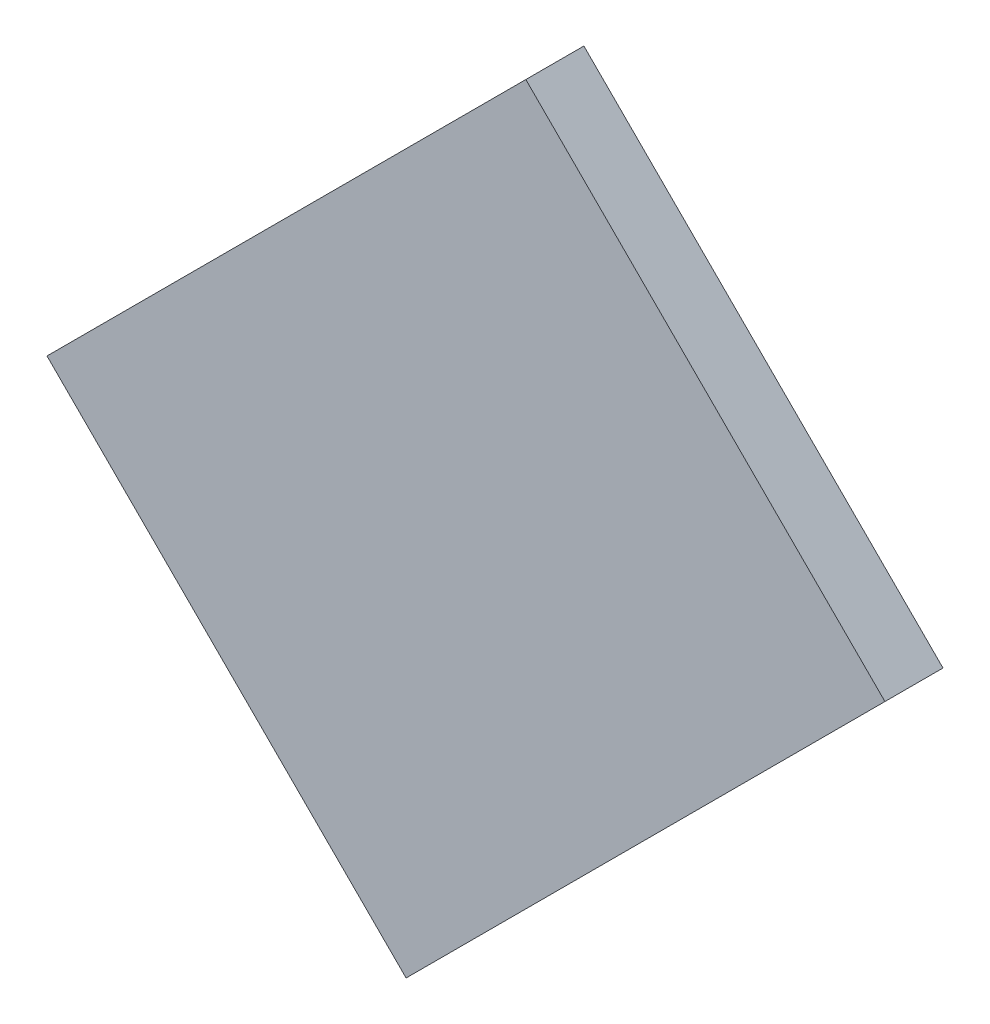
ISO-10303-21;
HEADER;
FILE_DESCRIPTION(('STEP AP214'),'2;1');
FILE_NAME('part.step','',(''),(''),'','','');
FILE_SCHEMA(('AUTOMOTIVE_DESIGN { 1 0 10303 214 1 1 1 1 }'));
ENDSEC;
DATA;
#1=APPLICATION_CONTEXT('core data for automotive mechanical design processes');
#2=APPLICATION_PROTOCOL_DEFINITION('international standard','automotive_design',2000,#1);
#3=PRODUCT_CONTEXT('',#1,'mechanical');
#4=PRODUCT('Part','Part','',(#3));
#5=PRODUCT_RELATED_PRODUCT_CATEGORY('part','',(#4));
#6=PRODUCT_DEFINITION_FORMATION('','',#4);
#7=PRODUCT_DEFINITION_CONTEXT('part definition',#1,'design');
#8=PRODUCT_DEFINITION('design','',#6,#7);
#9=PRODUCT_DEFINITION_SHAPE('','',#8);
#10=(LENGTH_UNIT() NAMED_UNIT(*) SI_UNIT(.MILLI.,.METRE.));
#11=(NAMED_UNIT(*) PLANE_ANGLE_UNIT() SI_UNIT($,.RADIAN.));
#12=(NAMED_UNIT(*) SI_UNIT($,.STERADIAN.) SOLID_ANGLE_UNIT());
#13=UNCERTAINTY_MEASURE_WITH_UNIT(LENGTH_MEASURE(1.E-05),#10,'distance_accuracy_value','');
#14=(GEOMETRIC_REPRESENTATION_CONTEXT(3) GLOBAL_UNCERTAINTY_ASSIGNED_CONTEXT((#13)) GLOBAL_UNIT_ASSIGNED_CONTEXT((#10,
#11,#12)) REPRESENTATION_CONTEXT('',''));
#15=CARTESIAN_POINT('',(0.,0.,0.));
#16=DIRECTION('',(0.,0.,1.));
#17=DIRECTION('',(1.,0.,0.));
#18=AXIS2_PLACEMENT_3D('',#15,#16,#17);
#19=CARTESIAN_POINT('',(7.2985453335,7.7864546665,0.76487));
#20=DIRECTION('',(0.,0.,-1.));
#21=DIRECTION('',(-1.,0.,0.));
#22=AXIS2_PLACEMENT_3D('',#19,#20,#21);
#23=PLANE('',#22);
#24=DIRECTION('',(0.707106781186548,0.707106781186548,0.));
#25=VECTOR('',#24,1.);
#26=CARTESIAN_POINT('',(7.051058,7.751099333,0.76487));
#27=LINE('',#26,#25);
#28=CARTESIAN_POINT('',(7.051058,7.751099333,0.76487));
#29=VERTEX_POINT('',#28);
#30=CARTESIAN_POINT('',(7.333900667,8.033942,0.76487));
#31=VERTEX_POINT('',#30);
#32=EDGE_CURVE('E55',#29,#31,#27,.T.);
#33=ORIENTED_EDGE('',*,*,#32,.T.);
#34=DIRECTION('',(0.707106781186548,-0.707106781186548,0.));
#35=VECTOR('',#34,1.);
#36=CARTESIAN_POINT('',(7.333900667,8.033942,0.76487));
#37=LINE('',#36,#35);
#38=CARTESIAN_POINT('',(7.546032667,7.82181,0.76487));
#39=VERTEX_POINT('',#38);
#40=EDGE_CURVE('E57',#31,#39,#37,.T.);
#41=ORIENTED_EDGE('',*,*,#40,.T.);
#42=DIRECTION('',(-0.707106781186548,-0.707106781186548,0.));
#43=VECTOR('',#42,1.);
#44=CARTESIAN_POINT('',(7.546032667,7.82181,0.76487));
#45=LINE('',#44,#43);
#46=CARTESIAN_POINT('',(7.26319,7.538967333,0.76487));
#47=VERTEX_POINT('',#46);
#48=EDGE_CURVE('E20',#39,#47,#45,.T.);
#49=ORIENTED_EDGE('',*,*,#48,.T.);
#50=DIRECTION('',(-0.707106781186548,0.707106781186548,0.));
#51=VECTOR('',#50,1.);
#52=CARTESIAN_POINT('',(7.26319,7.538967333,0.76487));
#53=LINE('',#52,#51);
#54=EDGE_CURVE('E80',#47,#29,#53,.T.);
#55=ORIENTED_EDGE('',*,*,#54,.T.);
#56=EDGE_LOOP('',(#33,#41,#49,#55));
#57=FACE_BOUND('',#56,.T.);
#58=ADVANCED_FACE('F17',(#57),#23,.T.);
#59=CARTESIAN_POINT('',(7.546032667,7.82181,0.76487));
#60=DIRECTION('',(-0.707106781186548,0.707106781186548,0.));
#61=DIRECTION('',(-0.707106781186548,-0.707106781186548,0.));
#62=AXIS2_PLACEMENT_3D('',#59,#60,#61);
#63=PLANE('',#62);
#64=DIRECTION('',(0.,0.,1.));
#65=VECTOR('',#64,1.);
#66=CARTESIAN_POINT('',(7.26319,7.538967333,0.76487));
#67=LINE('',#66,#65);
#68=CARTESIAN_POINT('',(7.26319,7.538967333,0.79916));
#69=VERTEX_POINT('',#68);
#70=EDGE_CURVE('E68',#69,#47,#67,.F.);
#71=ORIENTED_EDGE('',*,*,#70,.T.);
#72=ORIENTED_EDGE('',*,*,#48,.F.);
#73=DIRECTION('',(0.,0.,1.));
#74=VECTOR('',#73,1.);
#75=CARTESIAN_POINT('',(7.546032667,7.82181,0.76487));
#76=LINE('',#75,#74);
#77=CARTESIAN_POINT('',(7.546032667,7.82181,0.79916));
#78=VERTEX_POINT('',#77);
#79=EDGE_CURVE('E63',#39,#78,#76,.T.);
#80=ORIENTED_EDGE('',*,*,#79,.T.);
#81=DIRECTION('',(0.707106781186549,0.707106781186546,0.));
#82=VECTOR('',#81,1.);
#83=CARTESIAN_POINT('',(7.26319,7.538967333,0.79916));
#84=LINE('',#83,#82);
#85=EDGE_CURVE('E83',#69,#78,#84,.T.);
#86=ORIENTED_EDGE('',*,*,#85,.F.);
#87=EDGE_LOOP('',(#71,#72,#80,#86));
#88=FACE_BOUND('',#87,.T.);
#89=ADVANCED_FACE('F65',(#88),#63,.F.);
#90=CARTESIAN_POINT('',(7.333900667,8.033942,0.76487));
#91=DIRECTION('',(-0.707106781186548,-0.707106781186548,0.));
#92=DIRECTION('',(0.707106781186548,-0.707106781186548,0.));
#93=AXIS2_PLACEMENT_3D('',#90,#91,#92);
#94=PLANE('',#93);
#95=ORIENTED_EDGE('',*,*,#79,.F.);
#96=ORIENTED_EDGE('',*,*,#40,.F.);
#97=DIRECTION('',(0.,0.,1.));
#98=VECTOR('',#97,1.);
#99=CARTESIAN_POINT('',(7.333900667,8.033942,0.76487));
#100=LINE('',#99,#98);
#101=CARTESIAN_POINT('',(7.333900667,8.033942,0.79916));
#102=VERTEX_POINT('',#101);
#103=EDGE_CURVE('E75',#31,#102,#100,.T.);
#104=ORIENTED_EDGE('',*,*,#103,.T.);
#105=DIRECTION('',(-0.707106781186548,0.707106781186548,0.));
#106=VECTOR('',#105,1.);
#107=CARTESIAN_POINT('',(7.546032667,7.82181,0.79916));
#108=LINE('',#107,#106);
#109=EDGE_CURVE('E72',#78,#102,#108,.T.);
#110=ORIENTED_EDGE('',*,*,#109,.F.);
#111=EDGE_LOOP('',(#95,#96,#104,#110));
#112=FACE_BOUND('',#111,.T.);
#113=ADVANCED_FACE('F70',(#112),#94,.F.);
#114=CARTESIAN_POINT('',(7.051058,7.751099333,0.76487));
#115=DIRECTION('',(0.707106781186548,-0.707106781186548,0.));
#116=DIRECTION('',(0.707106781186548,0.707106781186548,0.));
#117=AXIS2_PLACEMENT_3D('',#114,#115,#116);
#118=PLANE('',#117);
#119=ORIENTED_EDGE('',*,*,#103,.F.);
#120=ORIENTED_EDGE('',*,*,#32,.F.);
#121=DIRECTION('',(0.,0.,1.));
#122=VECTOR('',#121,1.);
#123=CARTESIAN_POINT('',(7.051058,7.751099333,0.76487));
#124=LINE('',#123,#122);
#125=CARTESIAN_POINT('',(7.051058,7.751099333,0.79916));
#126=VERTEX_POINT('',#125);
#127=EDGE_CURVE('E35',#29,#126,#124,.T.);
#128=ORIENTED_EDGE('',*,*,#127,.T.);
#129=DIRECTION('',(-0.707106781186546,-0.707106781186549,0.));
#130=VECTOR('',#129,1.);
#131=CARTESIAN_POINT('',(7.333900667,8.033942,0.79916));
#132=LINE('',#131,#130);
#133=EDGE_CURVE('E26',#102,#126,#132,.T.);
#134=ORIENTED_EDGE('',*,*,#133,.F.);
#135=EDGE_LOOP('',(#119,#120,#128,#134));
#136=FACE_BOUND('',#135,.T.);
#137=ADVANCED_FACE('F89',(#136),#118,.F.);
#138=CARTESIAN_POINT('',(7.26319,7.538967333,0.76487));
#139=DIRECTION('',(0.707106781186548,0.707106781186548,0.));
#140=DIRECTION('',(-0.707106781186548,0.707106781186548,0.));
#141=AXIS2_PLACEMENT_3D('',#138,#139,#140);
#142=PLANE('',#141);
#143=ORIENTED_EDGE('',*,*,#127,.F.);
#144=ORIENTED_EDGE('',*,*,#54,.F.);
#145=ORIENTED_EDGE('',*,*,#70,.F.);
#146=DIRECTION('',(0.707106781186547,-0.707106781186547,0.));
#147=VECTOR('',#146,1.);
#148=CARTESIAN_POINT('',(7.051058,7.751099333,0.79916));
#149=LINE('',#148,#147);
#150=EDGE_CURVE('E11',#126,#69,#149,.T.);
#151=ORIENTED_EDGE('',*,*,#150,.F.);
#152=EDGE_LOOP('',(#143,#144,#145,#151));
#153=FACE_BOUND('',#152,.T.);
#154=ADVANCED_FACE('F91',(#153),#142,.F.);
#155=CARTESIAN_POINT('',(7.2985453335,7.7864546665,0.79916));
#156=DIRECTION('',(0.,0.,1.));
#157=DIRECTION('',(0.,-1.,0.));
#158=AXIS2_PLACEMENT_3D('',#155,#156,#157);
#159=PLANE('',#158);
#160=ORIENTED_EDGE('',*,*,#133,.T.);
#161=ORIENTED_EDGE('',*,*,#150,.T.);
#162=ORIENTED_EDGE('',*,*,#85,.T.);
#163=ORIENTED_EDGE('',*,*,#109,.T.);
#164=EDGE_LOOP('',(#160,#161,#162,#163));
#165=FACE_BOUND('',#164,.T.);
#166=ADVANCED_FACE('F88',(#165),#159,.T.);
#167=CLOSED_SHELL('',(#58,#89,#113,#137,#154,#166));
#168=MANIFOLD_SOLID_BREP('B1',#167);
#169=ADVANCED_BREP_SHAPE_REPRESENTATION('',(#18,#168),#14);
#170=SHAPE_DEFINITION_REPRESENTATION(#9,#169);
ENDSEC;
END-ISO-10303-21;
